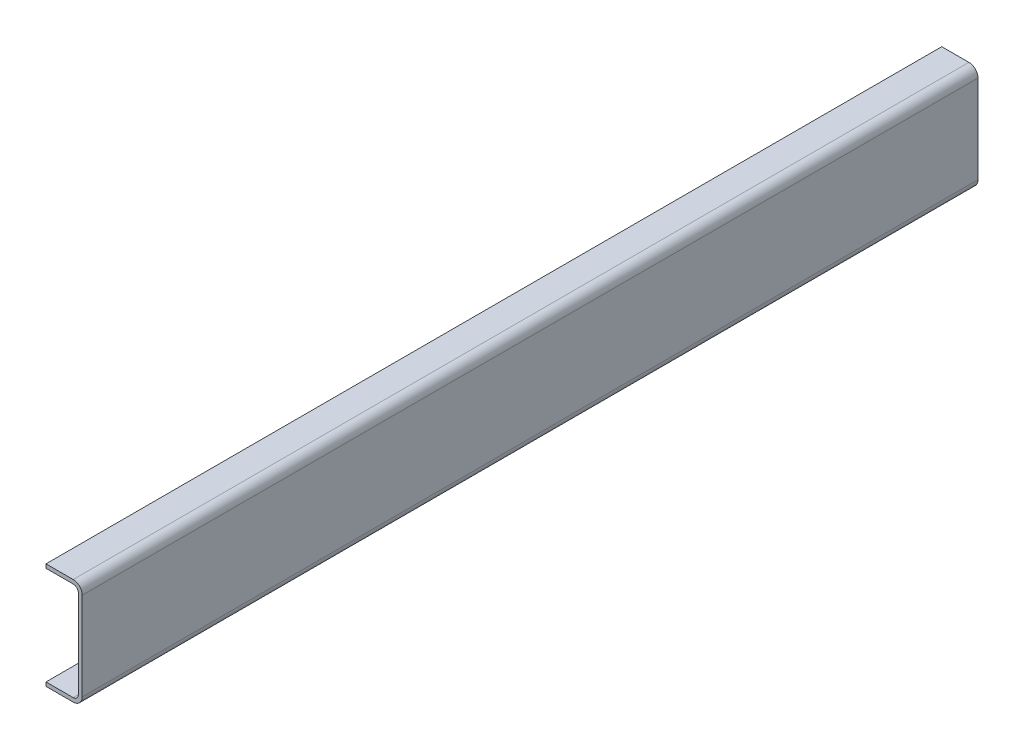
ISO-10303-21;
HEADER;
FILE_DESCRIPTION(('STEP AP214'),'2;1');
FILE_NAME('part.step','',(''),(''),'','','');
FILE_SCHEMA(('AUTOMOTIVE_DESIGN { 1 0 10303 214 1 1 1 1 }'));
ENDSEC;
DATA;
#1=APPLICATION_CONTEXT('core data for automotive mechanical design processes');
#2=APPLICATION_PROTOCOL_DEFINITION('international standard','automotive_design',2000,#1);
#3=PRODUCT_CONTEXT('',#1,'mechanical');
#4=PRODUCT('Part','Part','',(#3));
#5=PRODUCT_RELATED_PRODUCT_CATEGORY('part','',(#4));
#6=PRODUCT_DEFINITION_FORMATION('','',#4);
#7=PRODUCT_DEFINITION_CONTEXT('part definition',#1,'design');
#8=PRODUCT_DEFINITION('design','',#6,#7);
#9=PRODUCT_DEFINITION_SHAPE('','',#8);
#10=(LENGTH_UNIT() NAMED_UNIT(*) SI_UNIT(.MILLI.,.METRE.));
#11=(NAMED_UNIT(*) PLANE_ANGLE_UNIT() SI_UNIT($,.RADIAN.));
#12=(NAMED_UNIT(*) SI_UNIT($,.STERADIAN.) SOLID_ANGLE_UNIT());
#13=UNCERTAINTY_MEASURE_WITH_UNIT(LENGTH_MEASURE(1.E-05),#10,'distance_accuracy_value','');
#14=(GEOMETRIC_REPRESENTATION_CONTEXT(3) GLOBAL_UNCERTAINTY_ASSIGNED_CONTEXT((#13)) GLOBAL_UNIT_ASSIGNED_CONTEXT((#10,
#11,#12)) REPRESENTATION_CONTEXT('',''));
#15=CARTESIAN_POINT('',(0.,0.,0.));
#16=DIRECTION('',(0.,0.,1.));
#17=DIRECTION('',(1.,0.,0.));
#18=AXIS2_PLACEMENT_3D('',#15,#16,#17);
#19=CARTESIAN_POINT('',(-88.9,9.525,0.));
#20=DIRECTION('',(0.,0.,1.));
#21=DIRECTION('',(1.,0.,0.));
#22=AXIS2_PLACEMENT_3D('',#19,#20,#21);
#23=PLANE('',#22);
#24=DIRECTION('',(0.,-1.,0.));
#25=VECTOR('',#24,1.);
#26=CARTESIAN_POINT('',(0.,0.,0.));
#27=LINE('',#26,#25);
#28=CARTESIAN_POINT('',(0.,238.125,0.));
#29=VERTEX_POINT('',#28);
#30=CARTESIAN_POINT('',(0.,22.225,0.));
#31=VERTEX_POINT('',#30);
#32=EDGE_CURVE('E147',#29,#31,#27,.T.);
#33=ORIENTED_EDGE('',*,*,#32,.F.);
#34=CARTESIAN_POINT('',(-22.225,238.125,0.));
#35=DIRECTION('',(0.,0.,1.));
#36=DIRECTION('',(1.,0.,0.));
#37=AXIS2_PLACEMENT_3D('',#34,#35,#36);
#38=CIRCLE('',#37,22.225);
#39=CARTESIAN_POINT('',(-22.225,260.35,0.));
#40=VERTEX_POINT('',#39);
#41=EDGE_CURVE('E194',#29,#40,#38,.T.);
#42=ORIENTED_EDGE('',*,*,#41,.T.);
#43=DIRECTION('',(1.,0.,0.));
#44=VECTOR('',#43,1.);
#45=CARTESIAN_POINT('',(-88.9,260.35,0.));
#46=LINE('',#45,#44);
#47=CARTESIAN_POINT('',(-88.9,260.35,0.));
#48=VERTEX_POINT('',#47);
#49=EDGE_CURVE('E153',#48,#40,#46,.T.);
#50=ORIENTED_EDGE('',*,*,#49,.F.);
#51=DIRECTION('',(0.,1.,0.));
#52=VECTOR('',#51,1.);
#53=CARTESIAN_POINT('',(-88.9,250.825,0.));
#54=LINE('',#53,#52);
#55=CARTESIAN_POINT('',(-88.9,250.825,0.));
#56=VERTEX_POINT('',#55);
#57=EDGE_CURVE('E155',#56,#48,#54,.T.);
#58=ORIENTED_EDGE('',*,*,#57,.F.);
#59=DIRECTION('',(1.,0.,0.));
#60=VECTOR('',#59,1.);
#61=CARTESIAN_POINT('',(-88.9,250.825,0.));
#62=LINE('',#61,#60);
#63=CARTESIAN_POINT('',(-22.225,250.825,0.));
#64=VERTEX_POINT('',#63);
#65=EDGE_CURVE('E158',#56,#64,#62,.T.);
#66=ORIENTED_EDGE('',*,*,#65,.T.);
#67=CARTESIAN_POINT('',(-22.225,238.125,0.));
#68=DIRECTION('',(0.,0.,1.));
#69=DIRECTION('',(1.,0.,0.));
#70=AXIS2_PLACEMENT_3D('',#67,#68,#69);
#71=CIRCLE('',#70,12.7);
#72=CARTESIAN_POINT('',(-9.525,238.125,0.));
#73=VERTEX_POINT('',#72);
#74=EDGE_CURVE('E180',#64,#73,#71,.F.);
#75=ORIENTED_EDGE('',*,*,#74,.T.);
#76=DIRECTION('',(0.,1.,0.));
#77=VECTOR('',#76,1.);
#78=CARTESIAN_POINT('',(-9.525,0.,0.));
#79=LINE('',#78,#77);
#80=CARTESIAN_POINT('',(-9.525,22.225,0.));
#81=VERTEX_POINT('',#80);
#82=EDGE_CURVE('E140',#73,#81,#79,.F.);
#83=ORIENTED_EDGE('',*,*,#82,.T.);
#84=CARTESIAN_POINT('',(-22.225,22.225,0.));
#85=DIRECTION('',(0.,0.,1.));
#86=DIRECTION('',(1.,0.,0.));
#87=AXIS2_PLACEMENT_3D('',#84,#85,#86);
#88=CIRCLE('',#87,12.7);
#89=CARTESIAN_POINT('',(-22.225,9.525,0.));
#90=VERTEX_POINT('',#89);
#91=EDGE_CURVE('E128',#81,#90,#88,.F.);
#92=ORIENTED_EDGE('',*,*,#91,.T.);
#93=DIRECTION('',(1.,0.,0.));
#94=VECTOR('',#93,1.);
#95=CARTESIAN_POINT('',(-88.9,9.525,0.));
#96=LINE('',#95,#94);
#97=CARTESIAN_POINT('',(-88.9,9.525,0.));
#98=VERTEX_POINT('',#97);
#99=EDGE_CURVE('E121',#90,#98,#96,.F.);
#100=ORIENTED_EDGE('',*,*,#99,.T.);
#101=DIRECTION('',(0.,1.,0.));
#102=VECTOR('',#101,1.);
#103=CARTESIAN_POINT('',(-88.9,0.,0.));
#104=LINE('',#103,#102);
#105=CARTESIAN_POINT('',(-88.9,0.,0.));
#106=VERTEX_POINT('',#105);
#107=EDGE_CURVE('E126',#106,#98,#104,.T.);
#108=ORIENTED_EDGE('',*,*,#107,.F.);
#109=DIRECTION('',(-1.,0.,0.));
#110=VECTOR('',#109,1.);
#111=CARTESIAN_POINT('',(-88.9,0.,0.));
#112=LINE('',#111,#110);
#113=CARTESIAN_POINT('',(-22.225,0.,0.));
#114=VERTEX_POINT('',#113);
#115=EDGE_CURVE('E145',#114,#106,#112,.T.);
#116=ORIENTED_EDGE('',*,*,#115,.F.);
#117=CARTESIAN_POINT('',(-22.225,22.225,0.));
#118=DIRECTION('',(0.,0.,1.));
#119=DIRECTION('',(1.,0.,0.));
#120=AXIS2_PLACEMENT_3D('',#117,#118,#119);
#121=CIRCLE('',#120,22.225);
#122=EDGE_CURVE('E192',#114,#31,#121,.T.);
#123=ORIENTED_EDGE('',*,*,#122,.T.);
#124=EDGE_LOOP('',(#33,#42,#50,#58,#66,#75,#83,#92,#100,#108,#116,#123));
#125=FACE_BOUND('',#124,.T.);
#126=ADVANCED_FACE('F30',(#125),#23,.T.);
#127=CARTESIAN_POINT('',(-88.9,0.,-2472.20967358492));
#128=DIRECTION('',(1.,0.,0.));
#129=DIRECTION('',(0.,0.,-1.));
#130=AXIS2_PLACEMENT_3D('',#127,#128,#129);
#131=PLANE('',#130);
#132=DIRECTION('',(0.,0.,1.));
#133=VECTOR('',#132,1.);
#134=CARTESIAN_POINT('',(-88.9,9.525,-2472.20967358492));
#135=LINE('',#134,#133);
#136=CARTESIAN_POINT('',(-88.9,9.525,-2197.1));
#137=VERTEX_POINT('',#136);
#138=EDGE_CURVE('E134',#137,#98,#135,.T.);
#139=ORIENTED_EDGE('',*,*,#138,.F.);
#140=DIRECTION('',(0.,-1.,0.));
#141=VECTOR('',#140,1.);
#142=CARTESIAN_POINT('',(-88.9,0.,-2197.1));
#143=LINE('',#142,#141);
#144=CARTESIAN_POINT('',(-88.9,0.,-2197.1));
#145=VERTEX_POINT('',#144);
#146=EDGE_CURVE('E164',#137,#145,#143,.T.);
#147=ORIENTED_EDGE('',*,*,#146,.T.);
#148=DIRECTION('',(0.,0.,1.));
#149=VECTOR('',#148,1.);
#150=CARTESIAN_POINT('',(-88.9,0.,-2472.20967358492));
#151=LINE('',#150,#149);
#152=EDGE_CURVE('E139',#145,#106,#151,.T.);
#153=ORIENTED_EDGE('',*,*,#152,.T.);
#154=ORIENTED_EDGE('',*,*,#107,.T.);
#155=EDGE_LOOP('',(#139,#147,#153,#154));
#156=FACE_BOUND('',#155,.T.);
#157=ADVANCED_FACE('F143',(#156),#131,.F.);
#158=CARTESIAN_POINT('',(-88.9,0.,-2472.20967358492));
#159=DIRECTION('',(0.,1.,0.));
#160=DIRECTION('',(0.,0.,1.));
#161=AXIS2_PLACEMENT_3D('',#158,#159,#160);
#162=PLANE('',#161);
#163=DIRECTION('',(1.,0.,0.));
#164=VECTOR('',#163,1.);
#165=CARTESIAN_POINT('',(-88.9,0.,-2197.1));
#166=LINE('',#165,#164);
#167=CARTESIAN_POINT('',(-22.225,0.,-2197.1));
#168=VERTEX_POINT('',#167);
#169=EDGE_CURVE('E169',#145,#168,#166,.T.);
#170=ORIENTED_EDGE('',*,*,#169,.T.);
#171=DIRECTION('',(0.,0.,1.));
#172=VECTOR('',#171,1.);
#173=CARTESIAN_POINT('',(-22.225,0.,-2472.20967358492));
#174=LINE('',#173,#172);
#175=EDGE_CURVE('E11',#168,#114,#174,.T.);
#176=ORIENTED_EDGE('',*,*,#175,.T.);
#177=ORIENTED_EDGE('',*,*,#115,.T.);
#178=ORIENTED_EDGE('',*,*,#152,.F.);
#179=EDGE_LOOP('',(#170,#176,#177,#178));
#180=FACE_BOUND('',#179,.T.);
#181=ADVANCED_FACE('F246',(#180),#162,.F.);
#182=CARTESIAN_POINT('',(0.,0.,-2472.20967358492));
#183=DIRECTION('',(-1.,0.,0.));
#184=DIRECTION('',(0.,0.,1.));
#185=AXIS2_PLACEMENT_3D('',#182,#183,#184);
#186=PLANE('',#185);
#187=DIRECTION('',(0.,1.,0.));
#188=VECTOR('',#187,1.);
#189=CARTESIAN_POINT('',(0.,0.,-2197.1));
#190=LINE('',#189,#188);
#191=CARTESIAN_POINT('',(0.,22.225,-2197.1));
#192=VERTEX_POINT('',#191);
#193=CARTESIAN_POINT('',(0.,238.125,-2197.1));
#194=VERTEX_POINT('',#193);
#195=EDGE_CURVE('E200',#192,#194,#190,.T.);
#196=ORIENTED_EDGE('',*,*,#195,.T.);
#197=DIRECTION('',(0.,0.,1.));
#198=VECTOR('',#197,1.);
#199=CARTESIAN_POINT('',(0.,238.125,-2472.20967358492));
#200=LINE('',#199,#198);
#201=EDGE_CURVE('E189',#194,#29,#200,.T.);
#202=ORIENTED_EDGE('',*,*,#201,.T.);
#203=ORIENTED_EDGE('',*,*,#32,.T.);
#204=DIRECTION('',(0.,0.,1.));
#205=VECTOR('',#204,1.);
#206=CARTESIAN_POINT('',(0.,22.225,-2472.20967358492));
#207=LINE('',#206,#205);
#208=EDGE_CURVE('E187',#31,#192,#207,.F.);
#209=ORIENTED_EDGE('',*,*,#208,.T.);
#210=EDGE_LOOP('',(#196,#202,#203,#209));
#211=FACE_BOUND('',#210,.T.);
#212=ADVANCED_FACE('F206',(#211),#186,.F.);
#213=CARTESIAN_POINT('',(-88.9,260.35,-2472.20967358492));
#214=DIRECTION('',(0.,-1.,0.));
#215=DIRECTION('',(0.,0.,-1.));
#216=AXIS2_PLACEMENT_3D('',#213,#214,#215);
#217=PLANE('',#216);
#218=ORIENTED_EDGE('',*,*,#49,.T.);
#219=DIRECTION('',(0.,0.,1.));
#220=VECTOR('',#219,1.);
#221=CARTESIAN_POINT('',(-22.225,260.35,-2472.20967358492));
#222=LINE('',#221,#220);
#223=CARTESIAN_POINT('',(-22.225,260.35,-2197.1));
#224=VERTEX_POINT('',#223);
#225=EDGE_CURVE('E53',#40,#224,#222,.F.);
#226=ORIENTED_EDGE('',*,*,#225,.T.);
#227=DIRECTION('',(-1.,0.,0.));
#228=VECTOR('',#227,1.);
#229=CARTESIAN_POINT('',(-88.9,260.35,-2197.1));
#230=LINE('',#229,#228);
#231=CARTESIAN_POINT('',(-88.9,260.35,-2197.1));
#232=VERTEX_POINT('',#231);
#233=EDGE_CURVE('E202',#224,#232,#230,.T.);
#234=ORIENTED_EDGE('',*,*,#233,.T.);
#235=DIRECTION('',(0.,0.,1.));
#236=VECTOR('',#235,1.);
#237=CARTESIAN_POINT('',(-88.9,260.35,-2472.20967358492));
#238=LINE('',#237,#236);
#239=EDGE_CURVE('E165',#232,#48,#238,.T.);
#240=ORIENTED_EDGE('',*,*,#239,.T.);
#241=EDGE_LOOP('',(#218,#226,#234,#240));
#242=FACE_BOUND('',#241,.T.);
#243=ADVANCED_FACE('F212',(#242),#217,.F.);
#244=CARTESIAN_POINT('',(-88.9,250.825,-2472.20967358492));
#245=DIRECTION('',(1.,0.,0.));
#246=DIRECTION('',(0.,0.,-1.));
#247=AXIS2_PLACEMENT_3D('',#244,#245,#246);
#248=PLANE('',#247);
#249=ORIENTED_EDGE('',*,*,#239,.F.);
#250=DIRECTION('',(0.,-1.,0.));
#251=VECTOR('',#250,1.);
#252=CARTESIAN_POINT('',(-88.9,250.825,-2197.1));
#253=LINE('',#252,#251);
#254=CARTESIAN_POINT('',(-88.9,250.825,-2197.1));
#255=VERTEX_POINT('',#254);
#256=EDGE_CURVE('E241',#232,#255,#253,.T.);
#257=ORIENTED_EDGE('',*,*,#256,.T.);
#258=DIRECTION('',(0.,0.,1.));
#259=VECTOR('',#258,1.);
#260=CARTESIAN_POINT('',(-88.9,250.825,-2472.20967358492));
#261=LINE('',#260,#259);
#262=EDGE_CURVE('E162',#255,#56,#261,.T.);
#263=ORIENTED_EDGE('',*,*,#262,.T.);
#264=ORIENTED_EDGE('',*,*,#57,.T.);
#265=EDGE_LOOP('',(#249,#257,#263,#264));
#266=FACE_BOUND('',#265,.T.);
#267=ADVANCED_FACE('F216',(#266),#248,.F.);
#268=CARTESIAN_POINT('',(-88.9,250.825,-2472.20967358492));
#269=DIRECTION('',(0.,-1.,0.));
#270=DIRECTION('',(0.,0.,-1.));
#271=AXIS2_PLACEMENT_3D('',#268,#269,#270);
#272=PLANE('',#271);
#273=DIRECTION('',(-1.,0.,0.));
#274=VECTOR('',#273,1.);
#275=CARTESIAN_POINT('',(-88.9,250.825,-2197.1));
#276=LINE('',#275,#274);
#277=CARTESIAN_POINT('',(-22.225,250.825,-2197.1));
#278=VERTEX_POINT('',#277);
#279=EDGE_CURVE('E223',#278,#255,#276,.T.);
#280=ORIENTED_EDGE('',*,*,#279,.F.);
#281=DIRECTION('',(0.,0.,1.));
#282=VECTOR('',#281,1.);
#283=CARTESIAN_POINT('',(-22.225,250.825,0.));
#284=LINE('',#283,#282);
#285=EDGE_CURVE('E170',#278,#64,#284,.T.);
#286=ORIENTED_EDGE('',*,*,#285,.T.);
#287=ORIENTED_EDGE('',*,*,#65,.F.);
#288=ORIENTED_EDGE('',*,*,#262,.F.);
#289=EDGE_LOOP('',(#280,#286,#287,#288));
#290=FACE_BOUND('',#289,.T.);
#291=ADVANCED_FACE('F221',(#290),#272,.T.);
#292=CARTESIAN_POINT('',(-9.525,0.,-2472.20967358492));
#293=DIRECTION('',(-1.,0.,0.));
#294=DIRECTION('',(0.,0.,1.));
#295=AXIS2_PLACEMENT_3D('',#292,#293,#294);
#296=PLANE('',#295);
#297=ORIENTED_EDGE('',*,*,#82,.F.);
#298=DIRECTION('',(0.,0.,1.));
#299=VECTOR('',#298,1.);
#300=CARTESIAN_POINT('',(-9.525,238.125,-2197.1));
#301=LINE('',#300,#299);
#302=CARTESIAN_POINT('',(-9.525,238.125,-2197.1));
#303=VERTEX_POINT('',#302);
#304=EDGE_CURVE('E176',#73,#303,#301,.F.);
#305=ORIENTED_EDGE('',*,*,#304,.T.);
#306=DIRECTION('',(0.,1.,0.));
#307=VECTOR('',#306,1.);
#308=CARTESIAN_POINT('',(-9.525,0.,-2197.1));
#309=LINE('',#308,#307);
#310=CARTESIAN_POINT('',(-9.525,22.225,-2197.1));
#311=VERTEX_POINT('',#310);
#312=EDGE_CURVE('E234',#311,#303,#309,.T.);
#313=ORIENTED_EDGE('',*,*,#312,.F.);
#314=DIRECTION('',(0.,0.,1.));
#315=VECTOR('',#314,1.);
#316=CARTESIAN_POINT('',(-9.525,22.225,0.));
#317=LINE('',#316,#315);
#318=EDGE_CURVE('E173',#311,#81,#317,.T.);
#319=ORIENTED_EDGE('',*,*,#318,.T.);
#320=EDGE_LOOP('',(#297,#305,#313,#319));
#321=FACE_BOUND('',#320,.T.);
#322=ADVANCED_FACE('F230',(#321),#296,.T.);
#323=CARTESIAN_POINT('',(-88.9,9.525,-2472.20967358492));
#324=DIRECTION('',(0.,1.,0.));
#325=DIRECTION('',(0.,0.,1.));
#326=AXIS2_PLACEMENT_3D('',#323,#324,#325);
#327=PLANE('',#326);
#328=ORIENTED_EDGE('',*,*,#99,.F.);
#329=DIRECTION('',(0.,0.,1.));
#330=VECTOR('',#329,1.);
#331=CARTESIAN_POINT('',(-22.225,9.525,-2197.1));
#332=LINE('',#331,#330);
#333=CARTESIAN_POINT('',(-22.225,9.525,-2197.1));
#334=VERTEX_POINT('',#333);
#335=EDGE_CURVE('E178',#90,#334,#332,.F.);
#336=ORIENTED_EDGE('',*,*,#335,.T.);
#337=DIRECTION('',(1.,0.,0.));
#338=VECTOR('',#337,1.);
#339=CARTESIAN_POINT('',(-88.9,9.525,-2197.1));
#340=LINE('',#339,#338);
#341=EDGE_CURVE('E136',#137,#334,#340,.T.);
#342=ORIENTED_EDGE('',*,*,#341,.F.);
#343=ORIENTED_EDGE('',*,*,#138,.T.);
#344=EDGE_LOOP('',(#328,#336,#342,#343));
#345=FACE_BOUND('',#344,.T.);
#346=ADVANCED_FACE('F32',(#345),#327,.T.);
#347=CARTESIAN_POINT('',(0.,0.,-2197.1));
#348=DIRECTION('',(0.,0.,1.));
#349=DIRECTION('',(1.,0.,0.));
#350=AXIS2_PLACEMENT_3D('',#347,#348,#349);
#351=PLANE('',#350);
#352=ORIENTED_EDGE('',*,*,#233,.F.);
#353=CARTESIAN_POINT('',(-22.225,238.125,-2197.1));
#354=DIRECTION('',(0.,0.,1.));
#355=DIRECTION('',(1.,0.,0.));
#356=AXIS2_PLACEMENT_3D('',#353,#354,#355);
#357=CIRCLE('',#356,22.225);
#358=EDGE_CURVE('E38',#224,#194,#357,.F.);
#359=ORIENTED_EDGE('',*,*,#358,.T.);
#360=ORIENTED_EDGE('',*,*,#195,.F.);
#361=CARTESIAN_POINT('',(-22.225,22.225,-2197.1));
#362=DIRECTION('',(0.,0.,1.));
#363=DIRECTION('',(1.,0.,0.));
#364=AXIS2_PLACEMENT_3D('',#361,#362,#363);
#365=CIRCLE('',#364,22.225);
#366=EDGE_CURVE('E45',#192,#168,#365,.F.);
#367=ORIENTED_EDGE('',*,*,#366,.T.);
#368=ORIENTED_EDGE('',*,*,#169,.F.);
#369=ORIENTED_EDGE('',*,*,#146,.F.);
#370=ORIENTED_EDGE('',*,*,#341,.T.);
#371=CARTESIAN_POINT('',(-22.225,22.225,-2197.1));
#372=DIRECTION('',(0.,0.,1.));
#373=DIRECTION('',(1.,0.,0.));
#374=AXIS2_PLACEMENT_3D('',#371,#372,#373);
#375=CIRCLE('',#374,12.7);
#376=EDGE_CURVE('E185',#334,#311,#375,.T.);
#377=ORIENTED_EDGE('',*,*,#376,.T.);
#378=ORIENTED_EDGE('',*,*,#312,.T.);
#379=CARTESIAN_POINT('',(-22.225,238.125,-2197.1));
#380=DIRECTION('',(0.,0.,1.));
#381=DIRECTION('',(1.,0.,0.));
#382=AXIS2_PLACEMENT_3D('',#379,#380,#381);
#383=CIRCLE('',#382,12.7);
#384=EDGE_CURVE('E182',#303,#278,#383,.T.);
#385=ORIENTED_EDGE('',*,*,#384,.T.);
#386=ORIENTED_EDGE('',*,*,#279,.T.);
#387=ORIENTED_EDGE('',*,*,#256,.F.);
#388=EDGE_LOOP('',(#352,#359,#360,#367,#368,#369,#370,#377,#378,#385,#386,#387));
#389=FACE_BOUND('',#388,.T.);
#390=ADVANCED_FACE('F199',(#389),#351,.F.);
#391=CARTESIAN_POINT('',(-22.225,238.125,-2472.20967358492));
#392=DIRECTION('',(0.,0.,-1.));
#393=DIRECTION('',(-1.,0.,0.));
#394=AXIS2_PLACEMENT_3D('',#391,#392,#393);
#395=CYLINDRICAL_SURFACE('',#394,12.7);
#396=ORIENTED_EDGE('',*,*,#384,.F.);
#397=ORIENTED_EDGE('',*,*,#304,.F.);
#398=ORIENTED_EDGE('',*,*,#74,.F.);
#399=ORIENTED_EDGE('',*,*,#285,.F.);
#400=EDGE_LOOP('',(#396,#397,#398,#399));
#401=FACE_BOUND('',#400,.T.);
#402=ADVANCED_FACE('F226',(#401),#395,.F.);
#403=CARTESIAN_POINT('',(-22.225,22.225,-2472.20967358492));
#404=DIRECTION('',(0.,0.,-1.));
#405=DIRECTION('',(-1.,0.,0.));
#406=AXIS2_PLACEMENT_3D('',#403,#404,#405);
#407=CYLINDRICAL_SURFACE('',#406,12.7);
#408=ORIENTED_EDGE('',*,*,#376,.F.);
#409=ORIENTED_EDGE('',*,*,#335,.F.);
#410=ORIENTED_EDGE('',*,*,#91,.F.);
#411=ORIENTED_EDGE('',*,*,#318,.F.);
#412=EDGE_LOOP('',(#408,#409,#410,#411));
#413=FACE_BOUND('',#412,.T.);
#414=ADVANCED_FACE('F237',(#413),#407,.F.);
#415=CARTESIAN_POINT('',(-22.225,238.125,-2472.20967358492));
#416=DIRECTION('',(0.,0.,1.));
#417=DIRECTION('',(1.,0.,0.));
#418=AXIS2_PLACEMENT_3D('',#415,#416,#417);
#419=CYLINDRICAL_SURFACE('',#418,22.225);
#420=ORIENTED_EDGE('',*,*,#358,.F.);
#421=ORIENTED_EDGE('',*,*,#225,.F.);
#422=ORIENTED_EDGE('',*,*,#41,.F.);
#423=ORIENTED_EDGE('',*,*,#201,.F.);
#424=EDGE_LOOP('',(#420,#421,#422,#423));
#425=FACE_BOUND('',#424,.T.);
#426=ADVANCED_FACE('F209',(#425),#419,.T.);
#427=CARTESIAN_POINT('',(-22.225,22.225,-2472.20967358492));
#428=DIRECTION('',(0.,0.,1.));
#429=DIRECTION('',(1.,0.,0.));
#430=AXIS2_PLACEMENT_3D('',#427,#428,#429);
#431=CYLINDRICAL_SURFACE('',#430,22.225);
#432=ORIENTED_EDGE('',*,*,#366,.F.);
#433=ORIENTED_EDGE('',*,*,#208,.F.);
#434=ORIENTED_EDGE('',*,*,#122,.F.);
#435=ORIENTED_EDGE('',*,*,#175,.F.);
#436=EDGE_LOOP('',(#432,#433,#434,#435));
#437=FACE_BOUND('',#436,.T.);
#438=ADVANCED_FACE('F248',(#437),#431,.T.);
#439=CLOSED_SHELL('',(#126,#157,#181,#212,#243,#267,#291,#322,#346,#390,#402,#414,#426,#438));
#440=MANIFOLD_SOLID_BREP('B2',#439);
#441=ADVANCED_BREP_SHAPE_REPRESENTATION('',(#18,#440),#14);
#442=SHAPE_DEFINITION_REPRESENTATION(#9,#441);
ENDSEC;
END-ISO-10303-21;
